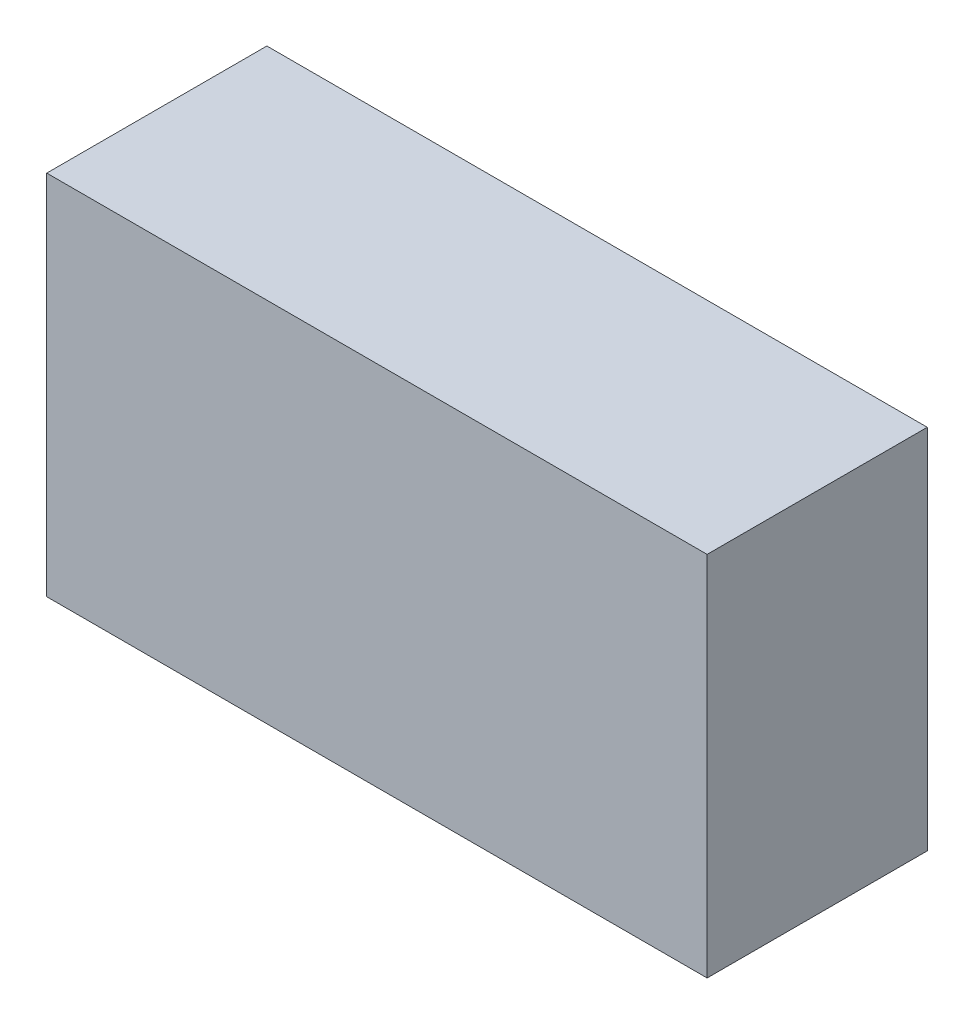
ISO-10303-21;
HEADER;
FILE_DESCRIPTION(('STEP AP214'),'2;1');
FILE_NAME('part.step','',(''),(''),'','','');
FILE_SCHEMA(('AUTOMOTIVE_DESIGN { 1 0 10303 214 1 1 1 1 }'));
ENDSEC;
DATA;
#1=APPLICATION_CONTEXT('core data for automotive mechanical design processes');
#2=APPLICATION_PROTOCOL_DEFINITION('international standard','automotive_design',2000,#1);
#3=PRODUCT_CONTEXT('',#1,'mechanical');
#4=PRODUCT('Part','Part','',(#3));
#5=PRODUCT_RELATED_PRODUCT_CATEGORY('part','',(#4));
#6=PRODUCT_DEFINITION_FORMATION('','',#4);
#7=PRODUCT_DEFINITION_CONTEXT('part definition',#1,'design');
#8=PRODUCT_DEFINITION('design','',#6,#7);
#9=PRODUCT_DEFINITION_SHAPE('','',#8);
#10=(LENGTH_UNIT() NAMED_UNIT(*) SI_UNIT(.MILLI.,.METRE.));
#11=(NAMED_UNIT(*) PLANE_ANGLE_UNIT() SI_UNIT($,.RADIAN.));
#12=(NAMED_UNIT(*) SI_UNIT($,.STERADIAN.) SOLID_ANGLE_UNIT());
#13=UNCERTAINTY_MEASURE_WITH_UNIT(LENGTH_MEASURE(1.E-05),#10,'distance_accuracy_value','');
#14=(GEOMETRIC_REPRESENTATION_CONTEXT(3) GLOBAL_UNCERTAINTY_ASSIGNED_CONTEXT((#13)) GLOBAL_UNIT_ASSIGNED_CONTEXT((#10,
#11,#12)) REPRESENTATION_CONTEXT('',''));
#15=CARTESIAN_POINT('',(0.,0.,0.));
#16=DIRECTION('',(0.,0.,1.));
#17=DIRECTION('',(1.,0.,0.));
#18=AXIS2_PLACEMENT_3D('',#15,#16,#17);
#19=CARTESIAN_POINT('',(0.45,-0.25,0.));
#20=DIRECTION('',(1.,0.,0.));
#21=DIRECTION('',(0.,1.,0.));
#22=AXIS2_PLACEMENT_3D('',#19,#20,#21);
#23=PLANE('',#22);
#24=DIRECTION('',(0.,-1.,0.));
#25=VECTOR('',#24,1.);
#26=CARTESIAN_POINT('',(0.45,0.25,0.));
#27=LINE('',#26,#25);
#28=CARTESIAN_POINT('',(0.45,0.25,0.));
#29=VERTEX_POINT('',#28);
#30=CARTESIAN_POINT('',(0.45,-0.25,0.));
#31=VERTEX_POINT('',#30);
#32=EDGE_CURVE('E40',#29,#31,#27,.T.);
#33=ORIENTED_EDGE('',*,*,#32,.F.);
#34=DIRECTION('',(0.,0.,1.));
#35=VECTOR('',#34,1.);
#36=CARTESIAN_POINT('',(0.45,0.25,0.));
#37=LINE('',#36,#35);
#38=CARTESIAN_POINT('',(0.45,0.25,0.3));
#39=VERTEX_POINT('',#38);
#40=EDGE_CURVE('E11',#29,#39,#37,.T.);
#41=ORIENTED_EDGE('',*,*,#40,.T.);
#42=DIRECTION('',(0.,1.,0.));
#43=VECTOR('',#42,1.);
#44=CARTESIAN_POINT('',(0.45,0.25,0.3));
#45=LINE('',#44,#43);
#46=CARTESIAN_POINT('',(0.45,-0.25,0.3));
#47=VERTEX_POINT('',#46);
#48=EDGE_CURVE('E62',#47,#39,#45,.T.);
#49=ORIENTED_EDGE('',*,*,#48,.F.);
#50=DIRECTION('',(0.,0.,1.));
#51=VECTOR('',#50,1.);
#52=CARTESIAN_POINT('',(0.45,-0.25,0.));
#53=LINE('',#52,#51);
#54=EDGE_CURVE('E28',#31,#47,#53,.T.);
#55=ORIENTED_EDGE('',*,*,#54,.F.);
#56=EDGE_LOOP('',(#33,#41,#49,#55));
#57=FACE_BOUND('',#56,.T.);
#58=ADVANCED_FACE('F17',(#57),#23,.T.);
#59=CARTESIAN_POINT('',(-0.45,-0.25,0.));
#60=DIRECTION('',(0.,-1.,0.));
#61=DIRECTION('',(-1.,0.,0.));
#62=AXIS2_PLACEMENT_3D('',#59,#60,#61);
#63=PLANE('',#62);
#64=DIRECTION('',(-1.,0.,0.));
#65=VECTOR('',#64,1.);
#66=CARTESIAN_POINT('',(0.45,-0.25,0.));
#67=LINE('',#66,#65);
#68=CARTESIAN_POINT('',(-0.45,-0.25,0.));
#69=VERTEX_POINT('',#68);
#70=EDGE_CURVE('E77',#31,#69,#67,.T.);
#71=ORIENTED_EDGE('',*,*,#70,.F.);
#72=ORIENTED_EDGE('',*,*,#54,.T.);
#73=DIRECTION('',(1.,0.,0.));
#74=VECTOR('',#73,1.);
#75=CARTESIAN_POINT('',(0.45,-0.25,0.3));
#76=LINE('',#75,#74);
#77=CARTESIAN_POINT('',(-0.45,-0.25,0.3));
#78=VERTEX_POINT('',#77);
#79=EDGE_CURVE('E70',#78,#47,#76,.T.);
#80=ORIENTED_EDGE('',*,*,#79,.F.);
#81=DIRECTION('',(0.,0.,1.));
#82=VECTOR('',#81,1.);
#83=CARTESIAN_POINT('',(-0.45,-0.25,0.));
#84=LINE('',#83,#82);
#85=EDGE_CURVE('E79',#69,#78,#84,.T.);
#86=ORIENTED_EDGE('',*,*,#85,.F.);
#87=EDGE_LOOP('',(#71,#72,#80,#86));
#88=FACE_BOUND('',#87,.T.);
#89=ADVANCED_FACE('F73',(#88),#63,.T.);
#90=CARTESIAN_POINT('',(-0.45,0.25,0.));
#91=DIRECTION('',(-1.,0.,0.));
#92=DIRECTION('',(0.,0.,1.));
#93=AXIS2_PLACEMENT_3D('',#90,#91,#92);
#94=PLANE('',#93);
#95=DIRECTION('',(0.,1.,0.));
#96=VECTOR('',#95,1.);
#97=CARTESIAN_POINT('',(-0.45,-0.25,0.));
#98=LINE('',#97,#96);
#99=CARTESIAN_POINT('',(-0.45,0.25,0.));
#100=VERTEX_POINT('',#99);
#101=EDGE_CURVE('E92',#69,#100,#98,.T.);
#102=ORIENTED_EDGE('',*,*,#101,.F.);
#103=ORIENTED_EDGE('',*,*,#85,.T.);
#104=DIRECTION('',(0.,-1.,0.));
#105=VECTOR('',#104,1.);
#106=CARTESIAN_POINT('',(-0.45,-0.25,0.3));
#107=LINE('',#106,#105);
#108=CARTESIAN_POINT('',(-0.45,0.25,0.3));
#109=VERTEX_POINT('',#108);
#110=EDGE_CURVE('E83',#109,#78,#107,.T.);
#111=ORIENTED_EDGE('',*,*,#110,.F.);
#112=DIRECTION('',(0.,0.,1.));
#113=VECTOR('',#112,1.);
#114=CARTESIAN_POINT('',(-0.45,0.25,0.));
#115=LINE('',#114,#113);
#116=EDGE_CURVE('E21',#100,#109,#115,.T.);
#117=ORIENTED_EDGE('',*,*,#116,.F.);
#118=EDGE_LOOP('',(#102,#103,#111,#117));
#119=FACE_BOUND('',#118,.T.);
#120=ADVANCED_FACE('F112',(#119),#94,.T.);
#121=CARTESIAN_POINT('',(0.45,0.25,0.));
#122=DIRECTION('',(0.,1.,0.));
#123=DIRECTION('',(1.,0.,0.));
#124=AXIS2_PLACEMENT_3D('',#121,#122,#123);
#125=PLANE('',#124);
#126=DIRECTION('',(1.,0.,0.));
#127=VECTOR('',#126,1.);
#128=CARTESIAN_POINT('',(-0.45,0.25,0.));
#129=LINE('',#128,#127);
#130=EDGE_CURVE('E101',#100,#29,#129,.T.);
#131=ORIENTED_EDGE('',*,*,#130,.F.);
#132=ORIENTED_EDGE('',*,*,#116,.T.);
#133=DIRECTION('',(-1.,0.,0.));
#134=VECTOR('',#133,1.);
#135=CARTESIAN_POINT('',(-0.45,0.25,0.3));
#136=LINE('',#135,#134);
#137=EDGE_CURVE('E89',#39,#109,#136,.T.);
#138=ORIENTED_EDGE('',*,*,#137,.F.);
#139=ORIENTED_EDGE('',*,*,#40,.F.);
#140=EDGE_LOOP('',(#131,#132,#138,#139));
#141=FACE_BOUND('',#140,.T.);
#142=ADVANCED_FACE('F19',(#141),#125,.T.);
#143=CARTESIAN_POINT('',(0.,0.,0.));
#144=DIRECTION('',(0.,0.,1.));
#145=DIRECTION('',(1.,0.,0.));
#146=AXIS2_PLACEMENT_3D('',#143,#144,#145);
#147=PLANE('',#146);
#148=ORIENTED_EDGE('',*,*,#130,.T.);
#149=ORIENTED_EDGE('',*,*,#32,.T.);
#150=ORIENTED_EDGE('',*,*,#70,.T.);
#151=ORIENTED_EDGE('',*,*,#101,.T.);
#152=EDGE_LOOP('',(#148,#149,#150,#151));
#153=FACE_BOUND('',#152,.T.);
#154=ADVANCED_FACE('F108',(#153),#147,.F.);
#155=CARTESIAN_POINT('',(0.,0.,0.3));
#156=DIRECTION('',(0.,0.,1.));
#157=DIRECTION('',(1.,0.,0.));
#158=AXIS2_PLACEMENT_3D('',#155,#156,#157);
#159=PLANE('',#158);
#160=ORIENTED_EDGE('',*,*,#137,.T.);
#161=ORIENTED_EDGE('',*,*,#110,.T.);
#162=ORIENTED_EDGE('',*,*,#79,.T.);
#163=ORIENTED_EDGE('',*,*,#48,.T.);
#164=EDGE_LOOP('',(#160,#161,#162,#163));
#165=FACE_BOUND('',#164,.T.);
#166=ADVANCED_FACE('F82',(#165),#159,.T.);
#167=CLOSED_SHELL('',(#58,#89,#120,#142,#154,#166));
#168=MANIFOLD_SOLID_BREP('B1',#167);
#169=ADVANCED_BREP_SHAPE_REPRESENTATION('',(#18,#168),#14);
#170=SHAPE_DEFINITION_REPRESENTATION(#9,#169);
ENDSEC;
END-ISO-10303-21;
